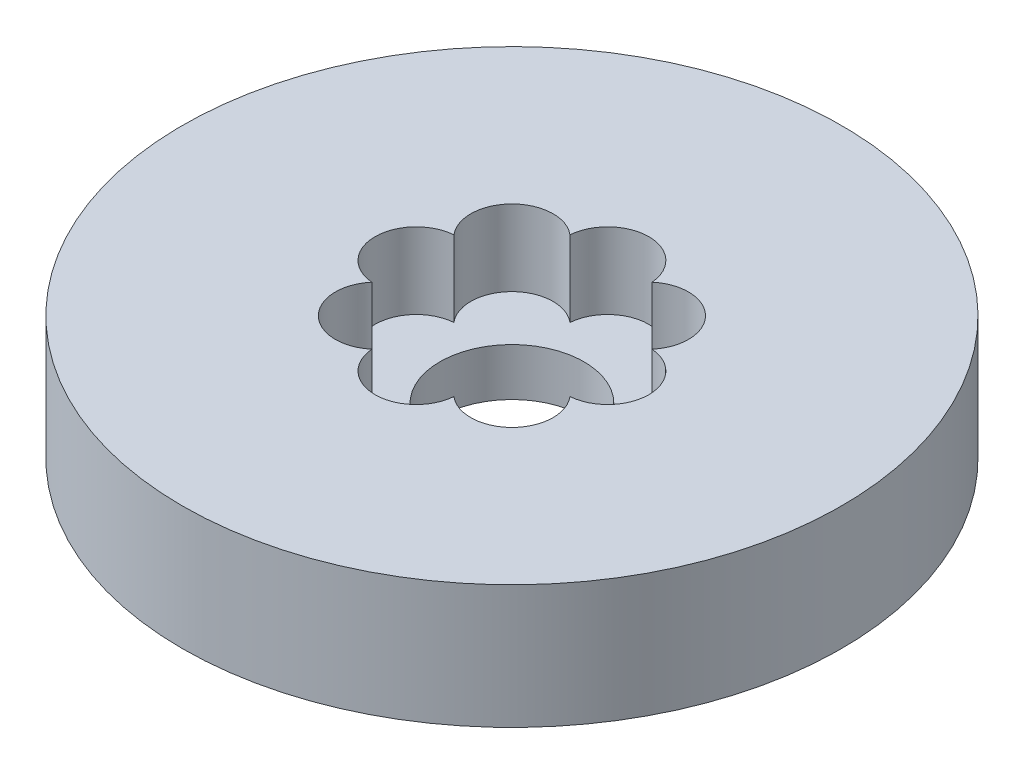
ISO-10303-21;
HEADER;
FILE_DESCRIPTION(('STEP AP214'),'2;1');
FILE_NAME('part.step','',(''),(''),'','','');
FILE_SCHEMA(('AUTOMOTIVE_DESIGN { 1 0 10303 214 1 1 1 1 }'));
ENDSEC;
DATA;
#1=APPLICATION_CONTEXT('core data for automotive mechanical design processes');
#2=APPLICATION_PROTOCOL_DEFINITION('international standard','automotive_design',2000,#1);
#3=PRODUCT_CONTEXT('',#1,'mechanical');
#4=PRODUCT('Part','Part','',(#3));
#5=PRODUCT_RELATED_PRODUCT_CATEGORY('part','',(#4));
#6=PRODUCT_DEFINITION_FORMATION('','',#4);
#7=PRODUCT_DEFINITION_CONTEXT('part definition',#1,'design');
#8=PRODUCT_DEFINITION('design','',#6,#7);
#9=PRODUCT_DEFINITION_SHAPE('','',#8);
#10=(LENGTH_UNIT() NAMED_UNIT(*) SI_UNIT(.MILLI.,.METRE.));
#11=(NAMED_UNIT(*) PLANE_ANGLE_UNIT() SI_UNIT($,.RADIAN.));
#12=(NAMED_UNIT(*) SI_UNIT($,.STERADIAN.) SOLID_ANGLE_UNIT());
#13=UNCERTAINTY_MEASURE_WITH_UNIT(LENGTH_MEASURE(1.E-05),#10,'distance_accuracy_value','');
#14=(GEOMETRIC_REPRESENTATION_CONTEXT(3) GLOBAL_UNCERTAINTY_ASSIGNED_CONTEXT((#13)) GLOBAL_UNIT_ASSIGNED_CONTEXT((#10,
#11,#12)) REPRESENTATION_CONTEXT('',''));
#15=CARTESIAN_POINT('',(0.,0.,0.));
#16=DIRECTION('',(0.,0.,1.));
#17=DIRECTION('',(1.,0.,0.));
#18=AXIS2_PLACEMENT_3D('',#15,#16,#17);
#19=CARTESIAN_POINT('',(0.,30.,0.));
#20=DIRECTION('',(0.,-1.,0.));
#21=DIRECTION('',(0.,0.,-1.));
#22=AXIS2_PLACEMENT_3D('',#19,#20,#21);
#23=CYLINDRICAL_SURFACE('',#22,17.5);
#24=CARTESIAN_POINT('',(0.,0.,0.));
#25=DIRECTION('',(0.,1.,0.));
#26=DIRECTION('',(0.,0.,1.));
#27=AXIS2_PLACEMENT_3D('',#24,#25,#26);
#28=CIRCLE('',#27,17.5);
#29=CARTESIAN_POINT('',(0.,0.,17.5));
#30=VERTEX_POINT('',#29);
#31=EDGE_CURVE('E166',#30,#30,#28,.T.);
#32=ORIENTED_EDGE('',*,*,#31,.F.);
#33=EDGE_LOOP('',(#32));
#34=FACE_BOUND('',#33,.T.);
#35=CARTESIAN_POINT('',(0.,11.5679598455126,0.));
#36=DIRECTION('',(0.,1.,0.));
#37=DIRECTION('',(0.,0.,1.));
#38=AXIS2_PLACEMENT_3D('',#35,#36,#37);
#39=CIRCLE('',#38,17.5);
#40=CARTESIAN_POINT('',(0.,11.5679598455126,17.5));
#41=VERTEX_POINT('',#40);
#42=EDGE_CURVE('E11',#41,#41,#39,.T.);
#43=ORIENTED_EDGE('',*,*,#42,.T.);
#44=EDGE_LOOP('',(#43));
#45=FACE_BOUND('',#44,.T.);
#46=ADVANCED_FACE('F39',(#34,#45),#23,.F.);
#47=CARTESIAN_POINT('',(0.,30.,0.));
#48=DIRECTION('',(0.,-1.,0.));
#49=DIRECTION('',(0.,0.,-1.));
#50=AXIS2_PLACEMENT_3D('',#47,#48,#49);
#51=CYLINDRICAL_SURFACE('',#50,80.);
#52=CARTESIAN_POINT('',(0.,30.,0.));
#53=DIRECTION('',(0.,1.,0.));
#54=DIRECTION('',(0.,0.,1.));
#55=AXIS2_PLACEMENT_3D('',#52,#53,#54);
#56=CIRCLE('',#55,80.);
#57=CARTESIAN_POINT('',(0.,30.,80.));
#58=VERTEX_POINT('',#57);
#59=EDGE_CURVE('E50',#58,#58,#56,.T.);
#60=ORIENTED_EDGE('',*,*,#59,.F.);
#61=EDGE_LOOP('',(#60));
#62=FACE_BOUND('',#61,.T.);
#63=CARTESIAN_POINT('',(0.,0.,0.));
#64=DIRECTION('',(0.,1.,0.));
#65=DIRECTION('',(0.,0.,1.));
#66=AXIS2_PLACEMENT_3D('',#63,#64,#65);
#67=CIRCLE('',#66,80.);
#68=CARTESIAN_POINT('',(0.,0.,80.));
#69=VERTEX_POINT('',#68);
#70=EDGE_CURVE('E173',#69,#69,#67,.T.);
#71=ORIENTED_EDGE('',*,*,#70,.T.);
#72=EDGE_LOOP('',(#71));
#73=FACE_BOUND('',#72,.T.);
#74=ADVANCED_FACE('F41',(#62,#73),#51,.T.);
#75=CARTESIAN_POINT('',(0.,30.,0.));
#76=DIRECTION('',(0.,1.,0.));
#77=DIRECTION('',(0.,0.,1.));
#78=AXIS2_PLACEMENT_3D('',#75,#76,#77);
#79=PLANE('',#78);
#80=CARTESIAN_POINT('',(-16.4261969489601,30.,16.4261969489602));
#81=DIRECTION('',(0.,1.,0.));
#82=DIRECTION('',(0.707106781186549,0.,0.707106781186546));
#83=AXIS2_PLACEMENT_3D('',#80,#81,#82);
#84=CIRCLE('',#83,10.);
#85=CARTESIAN_POINT('',(-24.0590545455782,30.,9.96558669065259));
#86=VERTEX_POINT('',#85);
#87=CARTESIAN_POINT('',(-9.96558669065251,30.,24.0590545455783));
#88=VERTEX_POINT('',#87);
#89=EDGE_CURVE('E159',#86,#88,#84,.T.);
#90=ORIENTED_EDGE('',*,*,#89,.F.);
#91=CARTESIAN_POINT('',(-23.230150503431,30.,0.));
#92=DIRECTION('',(0.,1.,0.));
#93=DIRECTION('',(0.,0.,1.));
#94=AXIS2_PLACEMENT_3D('',#91,#92,#93);
#95=CIRCLE('',#94,10.);
#96=CARTESIAN_POINT('',(-24.0590545455786,30.,-9.96558669065256));
#97=VERTEX_POINT('',#96);
#98=EDGE_CURVE('E167',#97,#86,#95,.T.);
#99=ORIENTED_EDGE('',*,*,#98,.F.);
#100=CARTESIAN_POINT('',(-16.4261969489604,30.,-16.42619694896));
#101=DIRECTION('',(0.,1.,0.));
#102=DIRECTION('',(-0.707106781186539,0.,0.707106781186556));
#103=AXIS2_PLACEMENT_3D('',#100,#101,#102);
#104=CIRCLE('',#103,10.);
#105=CARTESIAN_POINT('',(-9.96558669065284,30.,-24.0590545455781));
#106=VERTEX_POINT('',#105);
#107=EDGE_CURVE('E53',#106,#97,#104,.T.);
#108=ORIENTED_EDGE('',*,*,#107,.F.);
#109=CARTESIAN_POINT('',(-2.4332291094374E-13,30.,-23.230150503431));
#110=DIRECTION('',(0.,1.,0.));
#111=DIRECTION('',(-1.,0.,0.));
#112=AXIS2_PLACEMENT_3D('',#109,#110,#111);
#113=CIRCLE('',#112,10.);
#114=CARTESIAN_POINT('',(9.96558669065234,30.,-24.0590545455783));
#115=VERTEX_POINT('',#114);
#116=EDGE_CURVE('E117',#115,#106,#113,.T.);
#117=ORIENTED_EDGE('',*,*,#116,.F.);
#118=CARTESIAN_POINT('',(16.42619694896,30.,-16.4261969489603));
#119=DIRECTION('',(0.,1.,0.));
#120=DIRECTION('',(-0.707106781186554,0.,-0.707106781186541));
#121=AXIS2_PLACEMENT_3D('',#118,#119,#120);
#122=CIRCLE('',#121,10.);
#123=CARTESIAN_POINT('',(24.059054545578,30.,-9.96558669065261));
#124=VERTEX_POINT('',#123);
#125=EDGE_CURVE('E120',#124,#115,#122,.T.);
#126=ORIENTED_EDGE('',*,*,#125,.F.);
#127=CARTESIAN_POINT('',(23.230150503431,30.,0.));
#128=DIRECTION('',(0.,1.,0.));
#129=DIRECTION('',(0.,0.,-1.));
#130=AXIS2_PLACEMENT_3D('',#127,#128,#129);
#131=CIRCLE('',#130,10.);
#132=CARTESIAN_POINT('',(24.0590545455784,30.,9.96558669065257));
#133=VERTEX_POINT('',#132);
#134=EDGE_CURVE('E136',#133,#124,#131,.T.);
#135=ORIENTED_EDGE('',*,*,#134,.F.);
#136=CARTESIAN_POINT('',(16.4261969489602,30.,16.4261969489601));
#137=DIRECTION('',(0.,1.,0.));
#138=DIRECTION('',(0.707106781186544,0.,-0.707106781186551));
#139=AXIS2_PLACEMENT_3D('',#136,#137,#138);
#140=CIRCLE('',#139,10.);
#141=CARTESIAN_POINT('',(9.96558669065267,30.,24.0590545455782));
#142=VERTEX_POINT('',#141);
#143=EDGE_CURVE('E138',#142,#133,#140,.T.);
#144=ORIENTED_EDGE('',*,*,#143,.F.);
#145=CARTESIAN_POINT('',(0.,30.,23.230150503431));
#146=DIRECTION('',(0.,1.,0.));
#147=DIRECTION('',(1.,0.,0.));
#148=AXIS2_PLACEMENT_3D('',#145,#146,#147);
#149=CIRCLE('',#148,10.);
#150=EDGE_CURVE('E146',#88,#142,#149,.T.);
#151=ORIENTED_EDGE('',*,*,#150,.F.);
#152=EDGE_LOOP('',(#90,#99,#108,#117,#126,#135,#144,#151));
#153=FACE_BOUND('',#152,.T.);
#154=ORIENTED_EDGE('',*,*,#59,.T.);
#155=EDGE_LOOP('',(#154));
#156=FACE_BOUND('',#155,.T.);
#157=ADVANCED_FACE('F181',(#153,#156),#79,.T.);
#158=CARTESIAN_POINT('',(0.,0.,0.));
#159=DIRECTION('',(0.,1.,0.));
#160=DIRECTION('',(0.,0.,1.));
#161=AXIS2_PLACEMENT_3D('',#158,#159,#160);
#162=PLANE('',#161);
#163=ORIENTED_EDGE('',*,*,#31,.T.);
#164=EDGE_LOOP('',(#163));
#165=FACE_BOUND('',#164,.T.);
#166=ORIENTED_EDGE('',*,*,#70,.F.);
#167=EDGE_LOOP('',(#166));
#168=FACE_BOUND('',#167,.T.);
#169=ADVANCED_FACE('F179',(#165,#168),#162,.F.);
#170=CARTESIAN_POINT('',(-23.230150503431,11.5679598455126,0.));
#171=DIRECTION('',(0.,1.,0.));
#172=DIRECTION('',(0.,0.,1.));
#173=AXIS2_PLACEMENT_3D('',#170,#171,#172);
#174=CYLINDRICAL_SURFACE('',#173,10.);
#175=ORIENTED_EDGE('',*,*,#98,.T.);
#176=DIRECTION('',(0.,1.,0.));
#177=VECTOR('',#176,1.);
#178=CARTESIAN_POINT('',(-24.0590545455782,20.7839799227563,9.96558669065259));
#179=LINE('',#178,#177);
#180=CARTESIAN_POINT('',(-24.0590545455782,11.5679598455126,9.96558669065259));
#181=VERTEX_POINT('',#180);
#182=EDGE_CURVE('E65',#86,#181,#179,.F.);
#183=ORIENTED_EDGE('',*,*,#182,.T.);
#184=CARTESIAN_POINT('',(-23.230150503431,11.5679598455126,0.));
#185=DIRECTION('',(0.,1.,0.));
#186=DIRECTION('',(0.,0.,1.));
#187=AXIS2_PLACEMENT_3D('',#184,#185,#186);
#188=CIRCLE('',#187,10.);
#189=CARTESIAN_POINT('',(-24.0590545455786,11.5679598455126,-9.96558669065255));
#190=VERTEX_POINT('',#189);
#191=EDGE_CURVE('E170',#190,#181,#188,.T.);
#192=ORIENTED_EDGE('',*,*,#191,.F.);
#193=DIRECTION('',(0.,1.,0.));
#194=VECTOR('',#193,1.);
#195=CARTESIAN_POINT('',(-24.0590545455786,20.7839799227563,-9.96558669065255));
#196=LINE('',#195,#194);
#197=EDGE_CURVE('E124',#190,#97,#196,.T.);
#198=ORIENTED_EDGE('',*,*,#197,.T.);
#199=EDGE_LOOP('',(#175,#183,#192,#198));
#200=FACE_BOUND('',#199,.T.);
#201=ADVANCED_FACE('F185',(#200),#174,.F.);
#202=CARTESIAN_POINT('',(-23.230150503431,11.5679598455126,0.));
#203=DIRECTION('',(0.,1.,0.));
#204=DIRECTION('',(0.,0.,1.));
#205=AXIS2_PLACEMENT_3D('',#202,#203,#204);
#206=PLANE('',#205);
#207=ORIENTED_EDGE('',*,*,#191,.T.);
#208=CARTESIAN_POINT('',(-16.4261969489601,11.5679598455126,16.4261969489602));
#209=DIRECTION('',(0.,1.,0.));
#210=DIRECTION('',(0.707106781186549,0.,0.707106781186546));
#211=AXIS2_PLACEMENT_3D('',#208,#209,#210);
#212=CIRCLE('',#211,10.);
#213=CARTESIAN_POINT('',(-9.9655866906525,11.5679598455126,24.0590545455783));
#214=VERTEX_POINT('',#213);
#215=EDGE_CURVE('E161',#181,#214,#212,.T.);
#216=ORIENTED_EDGE('',*,*,#215,.T.);
#217=CARTESIAN_POINT('',(0.,11.5679598455126,23.230150503431));
#218=DIRECTION('',(0.,1.,0.));
#219=DIRECTION('',(1.,0.,0.));
#220=AXIS2_PLACEMENT_3D('',#217,#218,#219);
#221=CIRCLE('',#220,10.);
#222=CARTESIAN_POINT('',(9.96558669065267,11.5679598455126,24.0590545455782));
#223=VERTEX_POINT('',#222);
#224=EDGE_CURVE('E149',#214,#223,#221,.T.);
#225=ORIENTED_EDGE('',*,*,#224,.T.);
#226=CARTESIAN_POINT('',(16.4261969489602,11.5679598455126,16.4261969489601));
#227=DIRECTION('',(0.,1.,0.));
#228=DIRECTION('',(0.707106781186544,0.,-0.707106781186551));
#229=AXIS2_PLACEMENT_3D('',#226,#227,#228);
#230=CIRCLE('',#229,10.);
#231=CARTESIAN_POINT('',(24.0590545455784,11.5679598455126,9.96558669065257));
#232=VERTEX_POINT('',#231);
#233=EDGE_CURVE('E143',#223,#232,#230,.T.);
#234=ORIENTED_EDGE('',*,*,#233,.T.);
#235=CARTESIAN_POINT('',(23.230150503431,11.5679598455126,0.));
#236=DIRECTION('',(0.,1.,0.));
#237=DIRECTION('',(0.,0.,-1.));
#238=AXIS2_PLACEMENT_3D('',#235,#236,#237);
#239=CIRCLE('',#238,10.);
#240=CARTESIAN_POINT('',(24.059054545578,11.5679598455126,-9.96558669065261));
#241=VERTEX_POINT('',#240);
#242=EDGE_CURVE('E140',#232,#241,#239,.T.);
#243=ORIENTED_EDGE('',*,*,#242,.T.);
#244=CARTESIAN_POINT('',(16.42619694896,11.5679598455126,-16.4261969489603));
#245=DIRECTION('',(0.,1.,0.));
#246=DIRECTION('',(-0.707106781186554,0.,-0.707106781186541));
#247=AXIS2_PLACEMENT_3D('',#244,#245,#246);
#248=CIRCLE('',#247,10.);
#249=CARTESIAN_POINT('',(9.96558669065234,11.5679598455126,-24.0590545455783));
#250=VERTEX_POINT('',#249);
#251=EDGE_CURVE('E111',#241,#250,#248,.T.);
#252=ORIENTED_EDGE('',*,*,#251,.T.);
#253=CARTESIAN_POINT('',(-2.4332291094374E-13,11.5679598455126,-23.230150503431));
#254=DIRECTION('',(0.,1.,0.));
#255=DIRECTION('',(-1.,0.,0.));
#256=AXIS2_PLACEMENT_3D('',#253,#254,#255);
#257=CIRCLE('',#256,10.);
#258=CARTESIAN_POINT('',(-9.96558669065284,11.5679598455126,-24.0590545455781));
#259=VERTEX_POINT('',#258);
#260=EDGE_CURVE('E104',#250,#259,#257,.T.);
#261=ORIENTED_EDGE('',*,*,#260,.T.);
#262=CARTESIAN_POINT('',(-16.4261969489604,11.5679598455126,-16.42619694896));
#263=DIRECTION('',(0.,1.,0.));
#264=DIRECTION('',(-0.707106781186539,0.,0.707106781186556));
#265=AXIS2_PLACEMENT_3D('',#262,#263,#264);
#266=CIRCLE('',#265,10.);
#267=EDGE_CURVE('E112',#259,#190,#266,.T.);
#268=ORIENTED_EDGE('',*,*,#267,.T.);
#269=EDGE_LOOP('',(#207,#216,#225,#234,#243,#252,#261,#268));
#270=FACE_BOUND('',#269,.T.);
#271=ORIENTED_EDGE('',*,*,#42,.F.);
#272=EDGE_LOOP('',(#271));
#273=FACE_BOUND('',#272,.T.);
#274=ADVANCED_FACE('F107',(#270,#273),#206,.T.);
#275=CARTESIAN_POINT('',(-16.4261969489601,11.5679598455126,16.4261969489602));
#276=DIRECTION('',(0.,1.,0.));
#277=DIRECTION('',(0.,0.,1.));
#278=AXIS2_PLACEMENT_3D('',#275,#276,#277);
#279=CYLINDRICAL_SURFACE('',#278,10.);
#280=ORIENTED_EDGE('',*,*,#89,.T.);
#281=DIRECTION('',(0.,1.,0.));
#282=VECTOR('',#281,1.);
#283=CARTESIAN_POINT('',(-9.9655866906525,20.7839799227563,24.0590545455783));
#284=LINE('',#283,#282);
#285=EDGE_CURVE('E160',#88,#214,#284,.F.);
#286=ORIENTED_EDGE('',*,*,#285,.T.);
#287=ORIENTED_EDGE('',*,*,#215,.F.);
#288=ORIENTED_EDGE('',*,*,#182,.F.);
#289=EDGE_LOOP('',(#280,#286,#287,#288));
#290=FACE_BOUND('',#289,.T.);
#291=ADVANCED_FACE('F202',(#290),#279,.F.);
#292=CARTESIAN_POINT('',(-16.4261969489604,11.5679598455126,-16.42619694896));
#293=DIRECTION('',(0.,1.,0.));
#294=DIRECTION('',(0.,0.,1.));
#295=AXIS2_PLACEMENT_3D('',#292,#293,#294);
#296=CYLINDRICAL_SURFACE('',#295,10.);
#297=ORIENTED_EDGE('',*,*,#267,.F.);
#298=DIRECTION('',(0.,1.,0.));
#299=VECTOR('',#298,1.);
#300=CARTESIAN_POINT('',(-9.96558669065284,20.7839799227563,-24.0590545455781));
#301=LINE('',#300,#299);
#302=EDGE_CURVE('E119',#106,#259,#301,.F.);
#303=ORIENTED_EDGE('',*,*,#302,.F.);
#304=ORIENTED_EDGE('',*,*,#107,.T.);
#305=ORIENTED_EDGE('',*,*,#197,.F.);
#306=EDGE_LOOP('',(#297,#303,#304,#305));
#307=FACE_BOUND('',#306,.T.);
#308=ADVANCED_FACE('F123',(#307),#296,.F.);
#309=CARTESIAN_POINT('',(0.,11.5679598455126,23.230150503431));
#310=DIRECTION('',(0.,1.,0.));
#311=DIRECTION('',(0.,0.,1.));
#312=AXIS2_PLACEMENT_3D('',#309,#310,#311);
#313=CYLINDRICAL_SURFACE('',#312,10.);
#314=ORIENTED_EDGE('',*,*,#150,.T.);
#315=DIRECTION('',(0.,1.,0.));
#316=VECTOR('',#315,1.);
#317=CARTESIAN_POINT('',(9.96558669065267,20.7839799227563,24.0590545455782));
#318=LINE('',#317,#316);
#319=EDGE_CURVE('E141',#142,#223,#318,.F.);
#320=ORIENTED_EDGE('',*,*,#319,.T.);
#321=ORIENTED_EDGE('',*,*,#224,.F.);
#322=ORIENTED_EDGE('',*,*,#285,.F.);
#323=EDGE_LOOP('',(#314,#320,#321,#322));
#324=FACE_BOUND('',#323,.T.);
#325=ADVANCED_FACE('F208',(#324),#313,.F.);
#326=CARTESIAN_POINT('',(16.4261969489602,11.5679598455126,16.4261969489601));
#327=DIRECTION('',(0.,1.,0.));
#328=DIRECTION('',(0.,0.,1.));
#329=AXIS2_PLACEMENT_3D('',#326,#327,#328);
#330=CYLINDRICAL_SURFACE('',#329,10.);
#331=DIRECTION('',(0.,1.,0.));
#332=VECTOR('',#331,1.);
#333=CARTESIAN_POINT('',(24.0590545455784,20.7839799227563,9.96558669065257));
#334=LINE('',#333,#332);
#335=EDGE_CURVE('E151',#133,#232,#334,.F.);
#336=ORIENTED_EDGE('',*,*,#335,.T.);
#337=ORIENTED_EDGE('',*,*,#233,.F.);
#338=ORIENTED_EDGE('',*,*,#319,.F.);
#339=ORIENTED_EDGE('',*,*,#143,.T.);
#340=EDGE_LOOP('',(#336,#337,#338,#339));
#341=FACE_BOUND('',#340,.T.);
#342=ADVANCED_FACE('F211',(#341),#330,.F.);
#343=CARTESIAN_POINT('',(23.230150503431,11.5679598455126,0.));
#344=DIRECTION('',(0.,1.,0.));
#345=DIRECTION('',(0.,0.,1.));
#346=AXIS2_PLACEMENT_3D('',#343,#344,#345);
#347=CYLINDRICAL_SURFACE('',#346,10.);
#348=ORIENTED_EDGE('',*,*,#134,.T.);
#349=DIRECTION('',(0.,1.,0.));
#350=VECTOR('',#349,1.);
#351=CARTESIAN_POINT('',(24.059054545578,20.7839799227563,-9.96558669065261));
#352=LINE('',#351,#350);
#353=EDGE_CURVE('E131',#124,#241,#352,.F.);
#354=ORIENTED_EDGE('',*,*,#353,.T.);
#355=ORIENTED_EDGE('',*,*,#242,.F.);
#356=ORIENTED_EDGE('',*,*,#335,.F.);
#357=EDGE_LOOP('',(#348,#354,#355,#356));
#358=FACE_BOUND('',#357,.T.);
#359=ADVANCED_FACE('F214',(#358),#347,.F.);
#360=CARTESIAN_POINT('',(16.42619694896,11.5679598455126,-16.4261969489603));
#361=DIRECTION('',(0.,1.,0.));
#362=DIRECTION('',(0.,0.,1.));
#363=AXIS2_PLACEMENT_3D('',#360,#361,#362);
#364=CYLINDRICAL_SURFACE('',#363,10.);
#365=DIRECTION('',(0.,1.,0.));
#366=VECTOR('',#365,1.);
#367=CARTESIAN_POINT('',(9.96558669065234,20.7839799227563,-24.0590545455783));
#368=LINE('',#367,#366);
#369=EDGE_CURVE('E154',#115,#250,#368,.F.);
#370=ORIENTED_EDGE('',*,*,#369,.T.);
#371=ORIENTED_EDGE('',*,*,#251,.F.);
#372=ORIENTED_EDGE('',*,*,#353,.F.);
#373=ORIENTED_EDGE('',*,*,#125,.T.);
#374=EDGE_LOOP('',(#370,#371,#372,#373));
#375=FACE_BOUND('',#374,.T.);
#376=ADVANCED_FACE('F218',(#375),#364,.F.);
#377=CARTESIAN_POINT('',(-2.4332291094374E-13,11.5679598455126,-23.230150503431));
#378=DIRECTION('',(0.,1.,0.));
#379=DIRECTION('',(0.,0.,1.));
#380=AXIS2_PLACEMENT_3D('',#377,#378,#379);
#381=CYLINDRICAL_SURFACE('',#380,10.);
#382=ORIENTED_EDGE('',*,*,#116,.T.);
#383=ORIENTED_EDGE('',*,*,#302,.T.);
#384=ORIENTED_EDGE('',*,*,#260,.F.);
#385=ORIENTED_EDGE('',*,*,#369,.F.);
#386=EDGE_LOOP('',(#382,#383,#384,#385));
#387=FACE_BOUND('',#386,.T.);
#388=ADVANCED_FACE('F121',(#387),#381,.F.);
#389=CLOSED_SHELL('',(#46,#74,#157,#169,#201,#274,#291,#308,#325,#342,#359,#376,#388));
#390=MANIFOLD_SOLID_BREP('B2',#389);
#391=ADVANCED_BREP_SHAPE_REPRESENTATION('',(#18,#390),#14);
#392=SHAPE_DEFINITION_REPRESENTATION(#9,#391);
ENDSEC;
END-ISO-10303-21;
